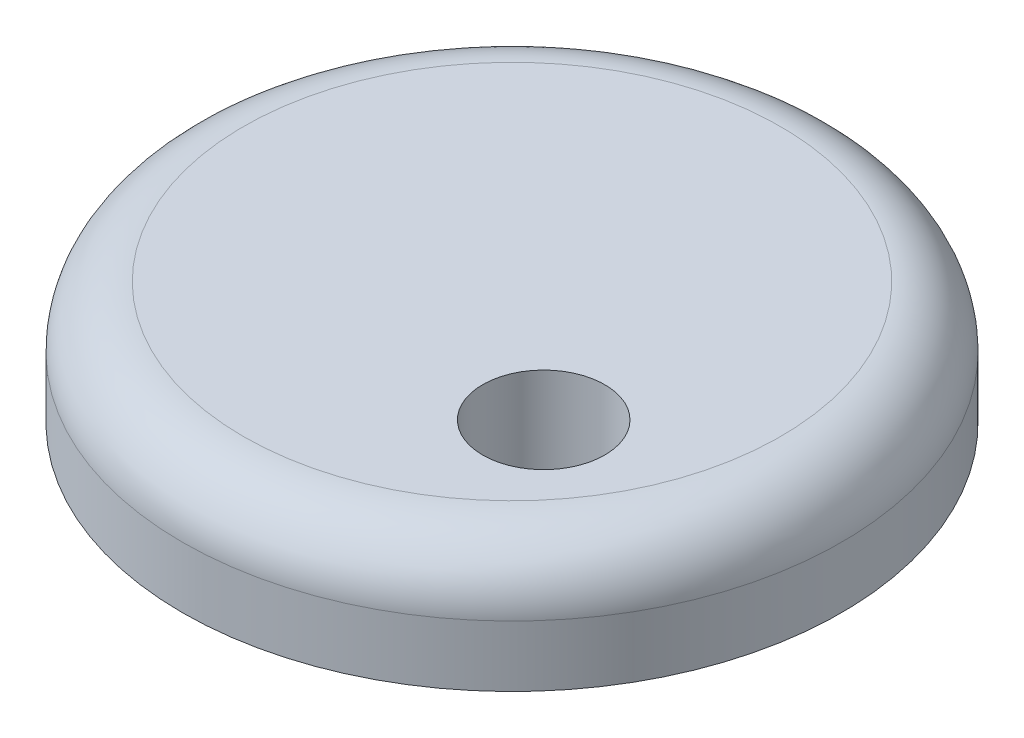
ISO-10303-21;
HEADER;
FILE_DESCRIPTION(('STEP AP214'),'2;1');
FILE_NAME('part.step','',(''),(''),'','','');
FILE_SCHEMA(('AUTOMOTIVE_DESIGN { 1 0 10303 214 1 1 1 1 }'));
ENDSEC;
DATA;
#1=APPLICATION_CONTEXT('core data for automotive mechanical design processes');
#2=APPLICATION_PROTOCOL_DEFINITION('international standard','automotive_design',2000,#1);
#3=PRODUCT_CONTEXT('',#1,'mechanical');
#4=PRODUCT('Part','Part','',(#3));
#5=PRODUCT_RELATED_PRODUCT_CATEGORY('part','',(#4));
#6=PRODUCT_DEFINITION_FORMATION('','',#4);
#7=PRODUCT_DEFINITION_CONTEXT('part definition',#1,'design');
#8=PRODUCT_DEFINITION('design','',#6,#7);
#9=PRODUCT_DEFINITION_SHAPE('','',#8);
#10=(LENGTH_UNIT() NAMED_UNIT(*) SI_UNIT(.MILLI.,.METRE.));
#11=(NAMED_UNIT(*) PLANE_ANGLE_UNIT() SI_UNIT($,.RADIAN.));
#12=(NAMED_UNIT(*) SI_UNIT($,.STERADIAN.) SOLID_ANGLE_UNIT());
#13=UNCERTAINTY_MEASURE_WITH_UNIT(LENGTH_MEASURE(1.E-05),#10,'distance_accuracy_value','');
#14=(GEOMETRIC_REPRESENTATION_CONTEXT(3) GLOBAL_UNCERTAINTY_ASSIGNED_CONTEXT((#13)) GLOBAL_UNIT_ASSIGNED_CONTEXT((#10,
#11,#12)) REPRESENTATION_CONTEXT('',''));
#15=CARTESIAN_POINT('',(0.,0.,0.));
#16=DIRECTION('',(0.,0.,1.));
#17=DIRECTION('',(1.,0.,0.));
#18=AXIS2_PLACEMENT_3D('',#15,#16,#17);
#19=CARTESIAN_POINT('',(0.,10.,0.));
#20=DIRECTION('',(0.,-1.,0.));
#21=DIRECTION('',(0.,0.,-1.));
#22=AXIS2_PLACEMENT_3D('',#19,#20,#21);
#23=CYLINDRICAL_SURFACE('',#22,27.);
#24=CARTESIAN_POINT('',(0.,5.,0.));
#25=DIRECTION('',(0.,1.,0.));
#26=DIRECTION('',(0.,0.,1.));
#27=AXIS2_PLACEMENT_3D('',#24,#25,#26);
#28=CIRCLE('',#27,27.);
#29=CARTESIAN_POINT('',(0.,5.,27.));
#30=VERTEX_POINT('',#29);
#31=EDGE_CURVE('E10',#30,#30,#28,.F.);
#32=ORIENTED_EDGE('',*,*,#31,.T.);
#33=EDGE_LOOP('',(#32));
#34=FACE_BOUND('',#33,.T.);
#35=CARTESIAN_POINT('',(0.,0.,0.));
#36=DIRECTION('',(0.,1.,0.));
#37=DIRECTION('',(0.,0.,1.));
#38=AXIS2_PLACEMENT_3D('',#35,#36,#37);
#39=CIRCLE('',#38,27.);
#40=CARTESIAN_POINT('',(0.,0.,27.));
#41=VERTEX_POINT('',#40);
#42=EDGE_CURVE('E42',#41,#41,#39,.T.);
#43=ORIENTED_EDGE('',*,*,#42,.T.);
#44=EDGE_LOOP('',(#43));
#45=FACE_BOUND('',#44,.T.);
#46=ADVANCED_FACE('F31',(#34,#45),#23,.T.);
#47=CARTESIAN_POINT('',(0.,10.,0.));
#48=DIRECTION('',(0.,1.,0.));
#49=DIRECTION('',(0.,0.,1.));
#50=AXIS2_PLACEMENT_3D('',#47,#48,#49);
#51=PLANE('',#50);
#52=CARTESIAN_POINT('',(11.1126795923357,10.,8.51518363149532));
#53=DIRECTION('',(0.,1.,0.));
#54=DIRECTION('',(0.,0.,1.));
#55=AXIS2_PLACEMENT_3D('',#52,#53,#54);
#56=CIRCLE('',#55,5.);
#57=CARTESIAN_POINT('',(11.1126795923357,10.,13.5151836314953));
#58=VERTEX_POINT('',#57);
#59=EDGE_CURVE('E49',#58,#58,#56,.T.);
#60=ORIENTED_EDGE('',*,*,#59,.F.);
#61=EDGE_LOOP('',(#60));
#62=FACE_BOUND('',#61,.T.);
#63=CARTESIAN_POINT('',(0.,10.,0.));
#64=DIRECTION('',(0.,1.,0.));
#65=DIRECTION('',(0.,0.,1.));
#66=AXIS2_PLACEMENT_3D('',#63,#64,#65);
#67=CIRCLE('',#66,22.);
#68=CARTESIAN_POINT('',(0.,10.,22.));
#69=VERTEX_POINT('',#68);
#70=EDGE_CURVE('E38',#69,#69,#67,.T.);
#71=ORIENTED_EDGE('',*,*,#70,.T.);
#72=EDGE_LOOP('',(#71));
#73=FACE_BOUND('',#72,.T.);
#74=ADVANCED_FACE('F64',(#62,#73),#51,.T.);
#75=CARTESIAN_POINT('',(0.,0.,0.));
#76=DIRECTION('',(0.,1.,0.));
#77=DIRECTION('',(0.,0.,1.));
#78=AXIS2_PLACEMENT_3D('',#75,#76,#77);
#79=PLANE('',#78);
#80=CARTESIAN_POINT('',(11.1126795923357,0.,8.51518363149532));
#81=DIRECTION('',(0.,1.,0.));
#82=DIRECTION('',(0.,0.,1.));
#83=AXIS2_PLACEMENT_3D('',#80,#81,#82);
#84=CIRCLE('',#83,5.);
#85=CARTESIAN_POINT('',(11.1126795923357,0.,13.5151836314953));
#86=VERTEX_POINT('',#85);
#87=EDGE_CURVE('E46',#86,#86,#84,.T.);
#88=ORIENTED_EDGE('',*,*,#87,.T.);
#89=EDGE_LOOP('',(#88));
#90=FACE_BOUND('',#89,.T.);
#91=ORIENTED_EDGE('',*,*,#42,.F.);
#92=EDGE_LOOP('',(#91));
#93=FACE_BOUND('',#92,.T.);
#94=ADVANCED_FACE('F55',(#90,#93),#79,.F.);
#95=CARTESIAN_POINT('',(0.,5.,0.));
#96=DIRECTION('',(0.,1.,0.));
#97=DIRECTION('',(0.,0.,1.));
#98=AXIS2_PLACEMENT_3D('',#95,#96,#97);
#99=TOROIDAL_SURFACE('',#98,22.,5.);
#100=ORIENTED_EDGE('',*,*,#31,.F.);
#101=EDGE_LOOP('',(#100));
#102=FACE_BOUND('',#101,.T.);
#103=ORIENTED_EDGE('',*,*,#70,.F.);
#104=EDGE_LOOP('',(#103));
#105=FACE_BOUND('',#104,.T.);
#106=ADVANCED_FACE('F33',(#102,#105),#99,.T.);
#107=CARTESIAN_POINT('',(11.1126795923357,0.,8.51518363149532));
#108=DIRECTION('',(0.,1.,0.));
#109=DIRECTION('',(0.,0.,1.));
#110=AXIS2_PLACEMENT_3D('',#107,#108,#109);
#111=CYLINDRICAL_SURFACE('',#110,5.);
#112=ORIENTED_EDGE('',*,*,#87,.F.);
#113=EDGE_LOOP('',(#112));
#114=FACE_BOUND('',#113,.T.);
#115=ORIENTED_EDGE('',*,*,#59,.T.);
#116=EDGE_LOOP('',(#115));
#117=FACE_BOUND('',#116,.T.);
#118=ADVANCED_FACE('F58',(#114,#117),#111,.F.);
#119=CLOSED_SHELL('',(#46,#74,#94,#106,#118));
#120=MANIFOLD_SOLID_BREP('B2',#119);
#121=ADVANCED_BREP_SHAPE_REPRESENTATION('',(#18,#120),#14);
#122=SHAPE_DEFINITION_REPRESENTATION(#9,#121);
ENDSEC;
END-ISO-10303-21;
